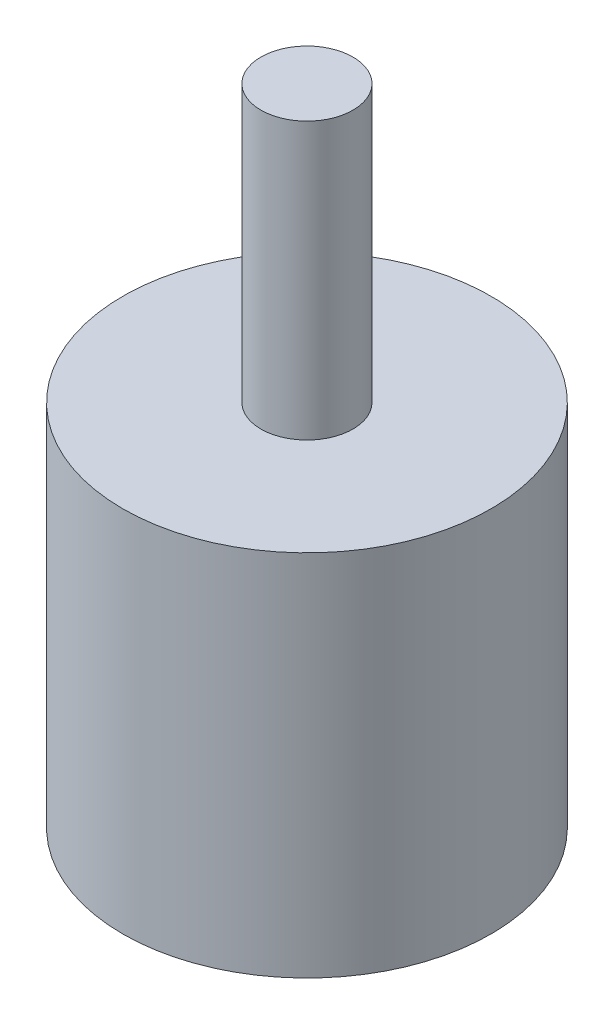
ISO-10303-21;
HEADER;
FILE_DESCRIPTION(('STEP AP214'),'2;1');
FILE_NAME('part.step','',(''),(''),'','','');
FILE_SCHEMA(('AUTOMOTIVE_DESIGN { 1 0 10303 214 1 1 1 1 }'));
ENDSEC;
DATA;
#1=APPLICATION_CONTEXT('core data for automotive mechanical design processes');
#2=APPLICATION_PROTOCOL_DEFINITION('international standard','automotive_design',2000,#1);
#3=PRODUCT_CONTEXT('',#1,'mechanical');
#4=PRODUCT('Part','Part','',(#3));
#5=PRODUCT_RELATED_PRODUCT_CATEGORY('part','',(#4));
#6=PRODUCT_DEFINITION_FORMATION('','',#4);
#7=PRODUCT_DEFINITION_CONTEXT('part definition',#1,'design');
#8=PRODUCT_DEFINITION('design','',#6,#7);
#9=PRODUCT_DEFINITION_SHAPE('','',#8);
#10=(LENGTH_UNIT() NAMED_UNIT(*) SI_UNIT(.MILLI.,.METRE.));
#11=(NAMED_UNIT(*) PLANE_ANGLE_UNIT() SI_UNIT($,.RADIAN.));
#12=(NAMED_UNIT(*) SI_UNIT($,.STERADIAN.) SOLID_ANGLE_UNIT());
#13=UNCERTAINTY_MEASURE_WITH_UNIT(LENGTH_MEASURE(1.E-05),#10,'distance_accuracy_value','');
#14=(GEOMETRIC_REPRESENTATION_CONTEXT(3) GLOBAL_UNCERTAINTY_ASSIGNED_CONTEXT((#13)) GLOBAL_UNIT_ASSIGNED_CONTEXT((#10,
#11,#12)) REPRESENTATION_CONTEXT('',''));
#15=CARTESIAN_POINT('',(0.,0.,0.));
#16=DIRECTION('',(0.,0.,1.));
#17=DIRECTION('',(1.,0.,0.));
#18=AXIS2_PLACEMENT_3D('',#15,#16,#17);
#19=CARTESIAN_POINT('',(0.,25.4,0.));
#20=DIRECTION('',(0.,-1.,0.));
#21=DIRECTION('',(0.,0.,-1.));
#22=AXIS2_PLACEMENT_3D('',#19,#20,#21);
#23=CYLINDRICAL_SURFACE('',#22,12.7);
#24=CARTESIAN_POINT('',(0.,25.4,0.));
#25=DIRECTION('',(0.,1.,0.));
#26=DIRECTION('',(0.,0.,1.));
#27=AXIS2_PLACEMENT_3D('',#24,#25,#26);
#28=CIRCLE('',#27,12.7);
#29=CARTESIAN_POINT('',(0.,25.4,12.7));
#30=VERTEX_POINT('',#29);
#31=EDGE_CURVE('E38',#30,#30,#28,.T.);
#32=ORIENTED_EDGE('',*,*,#31,.F.);
#33=EDGE_LOOP('',(#32));
#34=FACE_BOUND('',#33,.T.);
#35=CARTESIAN_POINT('',(0.,0.,0.));
#36=DIRECTION('',(0.,1.,0.));
#37=DIRECTION('',(0.,0.,1.));
#38=AXIS2_PLACEMENT_3D('',#35,#36,#37);
#39=CIRCLE('',#38,12.7);
#40=CARTESIAN_POINT('',(0.,0.,12.7));
#41=VERTEX_POINT('',#40);
#42=EDGE_CURVE('E34',#41,#41,#39,.T.);
#43=ORIENTED_EDGE('',*,*,#42,.T.);
#44=EDGE_LOOP('',(#43));
#45=FACE_BOUND('',#44,.T.);
#46=ADVANCED_FACE('F31',(#34,#45),#23,.T.);
#47=CARTESIAN_POINT('',(0.,25.4,0.));
#48=DIRECTION('',(0.,1.,0.));
#49=DIRECTION('',(0.,0.,1.));
#50=AXIS2_PLACEMENT_3D('',#47,#48,#49);
#51=PLANE('',#50);
#52=CARTESIAN_POINT('',(0.,25.4,0.));
#53=DIRECTION('',(0.,1.,0.));
#54=DIRECTION('',(0.,0.,1.));
#55=AXIS2_PLACEMENT_3D('',#52,#53,#54);
#56=CIRCLE('',#55,3.175);
#57=CARTESIAN_POINT('',(0.,25.4,3.175));
#58=VERTEX_POINT('',#57);
#59=EDGE_CURVE('E10',#58,#58,#56,.T.);
#60=ORIENTED_EDGE('',*,*,#59,.F.);
#61=EDGE_LOOP('',(#60));
#62=FACE_BOUND('',#61,.T.);
#63=ORIENTED_EDGE('',*,*,#31,.T.);
#64=EDGE_LOOP('',(#63));
#65=FACE_BOUND('',#64,.T.);
#66=ADVANCED_FACE('F55',(#62,#65),#51,.T.);
#67=CARTESIAN_POINT('',(0.,0.,0.));
#68=DIRECTION('',(0.,1.,0.));
#69=DIRECTION('',(0.,0.,1.));
#70=AXIS2_PLACEMENT_3D('',#67,#68,#69);
#71=PLANE('',#70);
#72=ORIENTED_EDGE('',*,*,#42,.F.);
#73=EDGE_LOOP('',(#72));
#74=FACE_BOUND('',#73,.T.);
#75=ADVANCED_FACE('F52',(#74),#71,.F.);
#76=CARTESIAN_POINT('',(0.,44.45,0.));
#77=DIRECTION('',(0.,-1.,0.));
#78=DIRECTION('',(0.,0.,-1.));
#79=AXIS2_PLACEMENT_3D('',#76,#77,#78);
#80=CYLINDRICAL_SURFACE('',#79,3.175);
#81=CARTESIAN_POINT('',(0.,44.45,0.));
#82=DIRECTION('',(0.,1.,0.));
#83=DIRECTION('',(0.,0.,1.));
#84=AXIS2_PLACEMENT_3D('',#81,#82,#83);
#85=CIRCLE('',#84,3.175);
#86=CARTESIAN_POINT('',(0.,44.45,3.175));
#87=VERTEX_POINT('',#86);
#88=EDGE_CURVE('E44',#87,#87,#85,.T.);
#89=ORIENTED_EDGE('',*,*,#88,.F.);
#90=EDGE_LOOP('',(#89));
#91=FACE_BOUND('',#90,.T.);
#92=ORIENTED_EDGE('',*,*,#59,.T.);
#93=EDGE_LOOP('',(#92));
#94=FACE_BOUND('',#93,.T.);
#95=ADVANCED_FACE('F54',(#91,#94),#80,.T.);
#96=CARTESIAN_POINT('',(0.,44.45,0.));
#97=DIRECTION('',(0.,1.,0.));
#98=DIRECTION('',(0.,0.,1.));
#99=AXIS2_PLACEMENT_3D('',#96,#97,#98);
#100=PLANE('',#99);
#101=ORIENTED_EDGE('',*,*,#88,.T.);
#102=EDGE_LOOP('',(#101));
#103=FACE_BOUND('',#102,.T.);
#104=ADVANCED_FACE('F60',(#103),#100,.T.);
#105=CLOSED_SHELL('',(#46,#66,#75,#95,#104));
#106=MANIFOLD_SOLID_BREP('B2',#105);
#107=ADVANCED_BREP_SHAPE_REPRESENTATION('',(#18,#106),#14);
#108=SHAPE_DEFINITION_REPRESENTATION(#9,#107);
ENDSEC;
END-ISO-10303-21;
